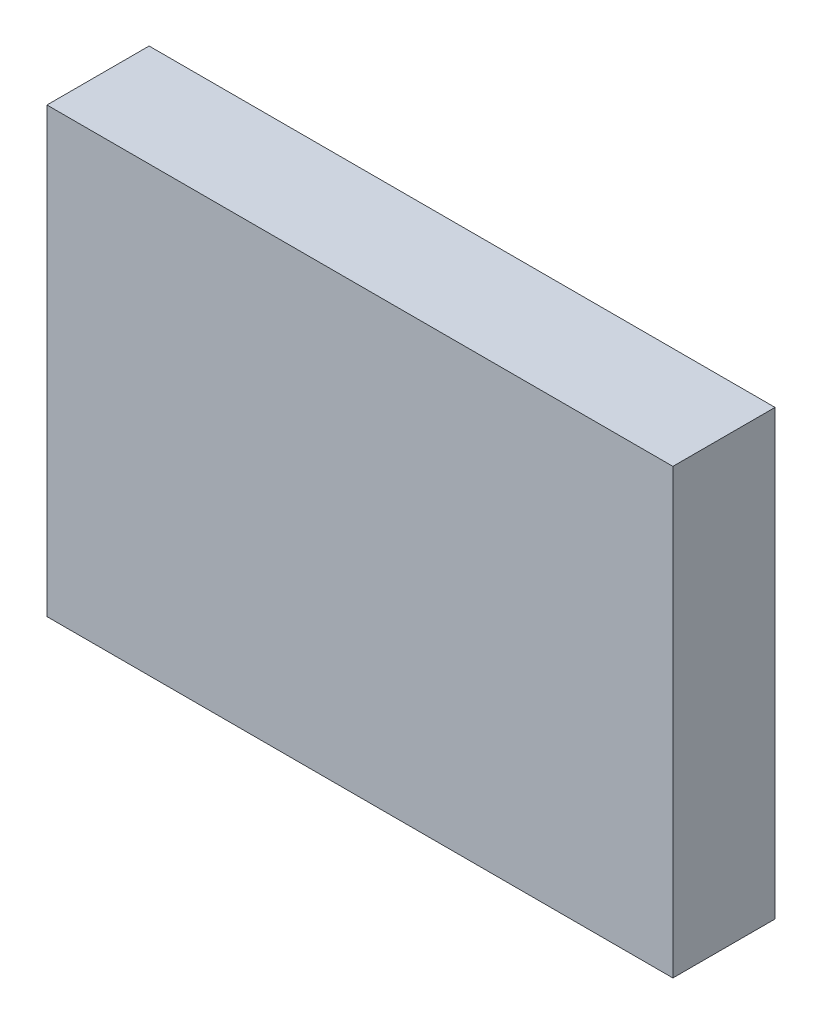
ISO-10303-21;
HEADER;
FILE_DESCRIPTION(('STEP AP214'),'2;1');
FILE_NAME('part.step','',(''),(''),'','','');
FILE_SCHEMA(('AUTOMOTIVE_DESIGN { 1 0 10303 214 1 1 1 1 }'));
ENDSEC;
DATA;
#1=APPLICATION_CONTEXT('core data for automotive mechanical design processes');
#2=APPLICATION_PROTOCOL_DEFINITION('international standard','automotive_design',2000,#1);
#3=PRODUCT_CONTEXT('',#1,'mechanical');
#4=PRODUCT('Part','Part','',(#3));
#5=PRODUCT_RELATED_PRODUCT_CATEGORY('part','',(#4));
#6=PRODUCT_DEFINITION_FORMATION('','',#4);
#7=PRODUCT_DEFINITION_CONTEXT('part definition',#1,'design');
#8=PRODUCT_DEFINITION('design','',#6,#7);
#9=PRODUCT_DEFINITION_SHAPE('','',#8);
#10=(LENGTH_UNIT() NAMED_UNIT(*) SI_UNIT(.MILLI.,.METRE.));
#11=(NAMED_UNIT(*) PLANE_ANGLE_UNIT() SI_UNIT($,.RADIAN.));
#12=(NAMED_UNIT(*) SI_UNIT($,.STERADIAN.) SOLID_ANGLE_UNIT());
#13=UNCERTAINTY_MEASURE_WITH_UNIT(LENGTH_MEASURE(1.E-05),#10,'distance_accuracy_value','');
#14=(GEOMETRIC_REPRESENTATION_CONTEXT(3) GLOBAL_UNCERTAINTY_ASSIGNED_CONTEXT((#13)) GLOBAL_UNIT_ASSIGNED_CONTEXT((#10,
#11,#12)) REPRESENTATION_CONTEXT('',''));
#15=CARTESIAN_POINT('',(0.,0.,0.));
#16=DIRECTION('',(0.,0.,1.));
#17=DIRECTION('',(1.,0.,0.));
#18=AXIS2_PLACEMENT_3D('',#15,#16,#17);
#19=CARTESIAN_POINT('',(-94.2841644233622,55.7449815409714,30.));
#20=DIRECTION('',(1.,0.,0.));
#21=DIRECTION('',(0.,0.,-1.));
#22=AXIS2_PLACEMENT_3D('',#19,#20,#21);
#23=PLANE('',#22);
#24=DIRECTION('',(0.,-1.,0.));
#25=VECTOR('',#24,1.);
#26=CARTESIAN_POINT('',(-94.2841644233622,55.7449815409714,0.));
#27=LINE('',#26,#25);
#28=CARTESIAN_POINT('',(-94.2841644233622,55.7449815409714,0.));
#29=VERTEX_POINT('',#28);
#30=CARTESIAN_POINT('',(-94.2841644233622,-74.3889583692518,0.));
#31=VERTEX_POINT('',#30);
#32=EDGE_CURVE('E123',#29,#31,#27,.T.);
#33=ORIENTED_EDGE('',*,*,#32,.T.);
#34=DIRECTION('',(0.,0.,-1.));
#35=VECTOR('',#34,1.);
#36=CARTESIAN_POINT('',(-94.2841644233622,-74.3889583692518,30.));
#37=LINE('',#36,#35);
#38=CARTESIAN_POINT('',(-94.2841644233622,-74.3889583692518,30.));
#39=VERTEX_POINT('',#38);
#40=EDGE_CURVE('E114',#39,#31,#37,.T.);
#41=ORIENTED_EDGE('',*,*,#40,.F.);
#42=DIRECTION('',(0.,-1.,0.));
#43=VECTOR('',#42,1.);
#44=CARTESIAN_POINT('',(-94.2841644233622,55.7449815409714,30.));
#45=LINE('',#44,#43);
#46=CARTESIAN_POINT('',(-94.2841644233622,55.7449815409714,30.));
#47=VERTEX_POINT('',#46);
#48=EDGE_CURVE('E108',#47,#39,#45,.T.);
#49=ORIENTED_EDGE('',*,*,#48,.F.);
#50=DIRECTION('',(0.,0.,-1.));
#51=VECTOR('',#50,1.);
#52=CARTESIAN_POINT('',(-94.2841644233622,55.7449815409714,30.));
#53=LINE('',#52,#51);
#54=EDGE_CURVE('E119',#47,#29,#53,.T.);
#55=ORIENTED_EDGE('',*,*,#54,.T.);
#56=EDGE_LOOP('',(#33,#41,#49,#55));
#57=FACE_BOUND('',#56,.T.);
#58=ADVANCED_FACE('F17',(#57),#23,.F.);
#59=CARTESIAN_POINT('',(-94.2841644233622,-74.3889583692518,30.));
#60=DIRECTION('',(0.,1.,0.));
#61=DIRECTION('',(0.,0.,1.));
#62=AXIS2_PLACEMENT_3D('',#59,#60,#61);
#63=PLANE('',#62);
#64=DIRECTION('',(1.,0.,0.));
#65=VECTOR('',#64,1.);
#66=CARTESIAN_POINT('',(-94.2841644233622,-74.3889583692518,0.));
#67=LINE('',#66,#65);
#68=CARTESIAN_POINT('',(89.5506165131049,-74.3889583692518,0.));
#69=VERTEX_POINT('',#68);
#70=EDGE_CURVE('E113',#31,#69,#67,.T.);
#71=ORIENTED_EDGE('',*,*,#70,.T.);
#72=DIRECTION('',(0.,0.,-1.));
#73=VECTOR('',#72,1.);
#74=CARTESIAN_POINT('',(89.5506165131049,-74.3889583692518,30.));
#75=LINE('',#74,#73);
#76=CARTESIAN_POINT('',(89.5506165131049,-74.3889583692518,30.));
#77=VERTEX_POINT('',#76);
#78=EDGE_CURVE('E111',#77,#69,#75,.T.);
#79=ORIENTED_EDGE('',*,*,#78,.F.);
#80=DIRECTION('',(1.,0.,0.));
#81=VECTOR('',#80,1.);
#82=CARTESIAN_POINT('',(-94.2841644233622,-74.3889583692518,30.));
#83=LINE('',#82,#81);
#84=EDGE_CURVE('E103',#39,#77,#83,.T.);
#85=ORIENTED_EDGE('',*,*,#84,.F.);
#86=ORIENTED_EDGE('',*,*,#40,.T.);
#87=EDGE_LOOP('',(#71,#79,#85,#86));
#88=FACE_BOUND('',#87,.T.);
#89=ADVANCED_FACE('F112',(#88),#63,.F.);
#90=CARTESIAN_POINT('',(89.5506165131049,55.7449815409714,30.));
#91=DIRECTION('',(-1.,0.,0.));
#92=DIRECTION('',(0.,0.,1.));
#93=AXIS2_PLACEMENT_3D('',#90,#91,#92);
#94=PLANE('',#93);
#95=DIRECTION('',(0.,1.,0.));
#96=VECTOR('',#95,1.);
#97=CARTESIAN_POINT('',(89.5506165131049,55.7449815409714,0.));
#98=LINE('',#97,#96);
#99=CARTESIAN_POINT('',(89.5506165131049,55.7449815409714,0.));
#100=VERTEX_POINT('',#99);
#101=EDGE_CURVE('E89',#69,#100,#98,.T.);
#102=ORIENTED_EDGE('',*,*,#101,.T.);
#103=DIRECTION('',(0.,0.,-1.));
#104=VECTOR('',#103,1.);
#105=CARTESIAN_POINT('',(89.5506165131049,55.7449815409714,30.));
#106=LINE('',#105,#104);
#107=CARTESIAN_POINT('',(89.5506165131049,55.7449815409714,30.));
#108=VERTEX_POINT('',#107);
#109=EDGE_CURVE('E115',#108,#100,#106,.T.);
#110=ORIENTED_EDGE('',*,*,#109,.F.);
#111=DIRECTION('',(0.,1.,0.));
#112=VECTOR('',#111,1.);
#113=CARTESIAN_POINT('',(89.5506165131049,55.7449815409714,30.));
#114=LINE('',#113,#112);
#115=EDGE_CURVE('E106',#77,#108,#114,.T.);
#116=ORIENTED_EDGE('',*,*,#115,.F.);
#117=ORIENTED_EDGE('',*,*,#78,.T.);
#118=EDGE_LOOP('',(#102,#110,#116,#117));
#119=FACE_BOUND('',#118,.T.);
#120=ADVANCED_FACE('F117',(#119),#94,.F.);
#121=CARTESIAN_POINT('',(-94.2841644233622,55.7449815409714,30.));
#122=DIRECTION('',(0.,-1.,0.));
#123=DIRECTION('',(0.,0.,-1.));
#124=AXIS2_PLACEMENT_3D('',#121,#122,#123);
#125=PLANE('',#124);
#126=DIRECTION('',(-1.,0.,0.));
#127=VECTOR('',#126,1.);
#128=CARTESIAN_POINT('',(-94.2841644233622,55.7449815409714,0.));
#129=LINE('',#128,#127);
#130=EDGE_CURVE('E95',#100,#29,#129,.T.);
#131=ORIENTED_EDGE('',*,*,#130,.T.);
#132=ORIENTED_EDGE('',*,*,#54,.F.);
#133=DIRECTION('',(-1.,0.,0.));
#134=VECTOR('',#133,1.);
#135=CARTESIAN_POINT('',(-94.2841644233622,55.7449815409714,30.));
#136=LINE('',#135,#134);
#137=EDGE_CURVE('E72',#108,#47,#136,.T.);
#138=ORIENTED_EDGE('',*,*,#137,.F.);
#139=ORIENTED_EDGE('',*,*,#109,.T.);
#140=EDGE_LOOP('',(#131,#132,#138,#139));
#141=FACE_BOUND('',#140,.T.);
#142=ADVANCED_FACE('F188',(#141),#125,.F.);
#143=CARTESIAN_POINT('',(0.,0.,30.));
#144=DIRECTION('',(0.,0.,1.));
#145=DIRECTION('',(1.,0.,0.));
#146=AXIS2_PLACEMENT_3D('',#143,#144,#145);
#147=PLANE('',#146);
#148=ORIENTED_EDGE('',*,*,#48,.T.);
#149=ORIENTED_EDGE('',*,*,#84,.T.);
#150=ORIENTED_EDGE('',*,*,#115,.T.);
#151=ORIENTED_EDGE('',*,*,#137,.T.);
#152=EDGE_LOOP('',(#148,#149,#150,#151));
#153=FACE_BOUND('',#152,.T.);
#154=ADVANCED_FACE('F104',(#153),#147,.T.);
#155=CARTESIAN_POINT('',(0.,0.,0.));
#156=DIRECTION('',(0.,0.,1.));
#157=DIRECTION('',(1.,0.,0.));
#158=AXIS2_PLACEMENT_3D('',#155,#156,#157);
#159=PLANE('',#158);
#160=ORIENTED_EDGE('',*,*,#32,.F.);
#161=ORIENTED_EDGE('',*,*,#130,.F.);
#162=ORIENTED_EDGE('',*,*,#101,.F.);
#163=ORIENTED_EDGE('',*,*,#70,.F.);
#164=EDGE_LOOP('',(#160,#161,#162,#163));
#165=FACE_BOUND('',#164,.T.);
#166=ADVANCED_FACE('F191',(#165),#159,.F.);
#167=CLOSED_SHELL('',(#58,#89,#120,#142,#154,#166));
#168=CARTESIAN_POINT('',(-93.2841644233622,55.7449815409714,30.));
#169=DIRECTION('',(1.,0.,0.));
#170=DIRECTION('',(0.,0.,-1.));
#171=AXIS2_PLACEMENT_3D('',#168,#169,#170);
#172=PLANE('',#171);
#173=DIRECTION('',(0.,-1.,0.));
#174=VECTOR('',#173,1.);
#175=CARTESIAN_POINT('',(-93.2841644233622,55.7449815409714,1.));
#176=LINE('',#175,#174);
#177=CARTESIAN_POINT('',(-93.2841644233622,54.7449815409714,1.));
#178=VERTEX_POINT('',#177);
#179=CARTESIAN_POINT('',(-93.2841644233622,-73.3889583692518,1.));
#180=VERTEX_POINT('',#179);
#181=EDGE_CURVE('E21',#178,#180,#176,.T.);
#182=ORIENTED_EDGE('',*,*,#181,.F.);
#183=DIRECTION('',(0.,0.,-1.));
#184=VECTOR('',#183,1.);
#185=CARTESIAN_POINT('',(-93.2841644233622,54.7449815409714,30.));
#186=LINE('',#185,#184);
#187=CARTESIAN_POINT('',(-93.2841644233622,54.7449815409714,29.));
#188=VERTEX_POINT('',#187);
#189=EDGE_CURVE('E147',#188,#178,#186,.T.);
#190=ORIENTED_EDGE('',*,*,#189,.F.);
#191=DIRECTION('',(0.,-1.,0.));
#192=VECTOR('',#191,1.);
#193=CARTESIAN_POINT('',(-93.2841644233622,55.7449815409714,29.));
#194=LINE('',#193,#192);
#195=CARTESIAN_POINT('',(-93.2841644233622,-73.3889583692518,29.));
#196=VERTEX_POINT('',#195);
#197=EDGE_CURVE('E134',#188,#196,#194,.T.);
#198=ORIENTED_EDGE('',*,*,#197,.T.);
#199=DIRECTION('',(0.,0.,-1.));
#200=VECTOR('',#199,1.);
#201=CARTESIAN_POINT('',(-93.2841644233622,-73.3889583692518,30.));
#202=LINE('',#201,#200);
#203=EDGE_CURVE('E145',#196,#180,#202,.T.);
#204=ORIENTED_EDGE('',*,*,#203,.T.);
#205=EDGE_LOOP('',(#182,#190,#198,#204));
#206=FACE_BOUND('',#205,.T.);
#207=ADVANCED_FACE('F154',(#206),#172,.T.);
#208=CARTESIAN_POINT('',(-94.2841644233622,-73.3889583692518,30.));
#209=DIRECTION('',(0.,1.,0.));
#210=DIRECTION('',(0.,0.,1.));
#211=AXIS2_PLACEMENT_3D('',#208,#209,#210);
#212=PLANE('',#211);
#213=DIRECTION('',(1.,0.,0.));
#214=VECTOR('',#213,1.);
#215=CARTESIAN_POINT('',(-94.2841644233622,-73.3889583692518,1.));
#216=LINE('',#215,#214);
#217=CARTESIAN_POINT('',(88.5506165131049,-73.3889583692518,1.));
#218=VERTEX_POINT('',#217);
#219=EDGE_CURVE('E37',#180,#218,#216,.T.);
#220=ORIENTED_EDGE('',*,*,#219,.F.);
#221=ORIENTED_EDGE('',*,*,#203,.F.);
#222=DIRECTION('',(1.,0.,0.));
#223=VECTOR('',#222,1.);
#224=CARTESIAN_POINT('',(-94.2841644233622,-73.3889583692518,29.));
#225=LINE('',#224,#223);
#226=CARTESIAN_POINT('',(88.5506165131049,-73.3889583692518,29.));
#227=VERTEX_POINT('',#226);
#228=EDGE_CURVE('E60',#196,#227,#225,.T.);
#229=ORIENTED_EDGE('',*,*,#228,.T.);
#230=DIRECTION('',(0.,0.,-1.));
#231=VECTOR('',#230,1.);
#232=CARTESIAN_POINT('',(88.5506165131049,-73.3889583692518,30.));
#233=LINE('',#232,#231);
#234=EDGE_CURVE('E141',#227,#218,#233,.T.);
#235=ORIENTED_EDGE('',*,*,#234,.T.);
#236=EDGE_LOOP('',(#220,#221,#229,#235));
#237=FACE_BOUND('',#236,.T.);
#238=ADVANCED_FACE('F155',(#237),#212,.T.);
#239=CARTESIAN_POINT('',(88.5506165131049,55.7449815409714,30.));
#240=DIRECTION('',(-1.,0.,0.));
#241=DIRECTION('',(0.,0.,1.));
#242=AXIS2_PLACEMENT_3D('',#239,#240,#241);
#243=PLANE('',#242);
#244=DIRECTION('',(0.,1.,0.));
#245=VECTOR('',#244,1.);
#246=CARTESIAN_POINT('',(88.5506165131049,55.7449815409714,1.));
#247=LINE('',#246,#245);
#248=CARTESIAN_POINT('',(88.5506165131049,54.7449815409714,1.));
#249=VERTEX_POINT('',#248);
#250=EDGE_CURVE('E143',#218,#249,#247,.T.);
#251=ORIENTED_EDGE('',*,*,#250,.F.);
#252=ORIENTED_EDGE('',*,*,#234,.F.);
#253=DIRECTION('',(0.,1.,0.));
#254=VECTOR('',#253,1.);
#255=CARTESIAN_POINT('',(88.5506165131049,55.7449815409714,29.));
#256=LINE('',#255,#254);
#257=CARTESIAN_POINT('',(88.5506165131049,54.7449815409714,29.));
#258=VERTEX_POINT('',#257);
#259=EDGE_CURVE('E28',#227,#258,#256,.T.);
#260=ORIENTED_EDGE('',*,*,#259,.T.);
#261=DIRECTION('',(0.,0.,-1.));
#262=VECTOR('',#261,1.);
#263=CARTESIAN_POINT('',(88.5506165131049,54.7449815409714,30.));
#264=LINE('',#263,#262);
#265=EDGE_CURVE('E136',#258,#249,#264,.T.);
#266=ORIENTED_EDGE('',*,*,#265,.T.);
#267=EDGE_LOOP('',(#251,#252,#260,#266));
#268=FACE_BOUND('',#267,.T.);
#269=ADVANCED_FACE('F159',(#268),#243,.T.);
#270=CARTESIAN_POINT('',(-94.2841644233622,54.7449815409714,30.));
#271=DIRECTION('',(0.,-1.,0.));
#272=DIRECTION('',(0.,0.,-1.));
#273=AXIS2_PLACEMENT_3D('',#270,#271,#272);
#274=PLANE('',#273);
#275=DIRECTION('',(-1.,0.,0.));
#276=VECTOR('',#275,1.);
#277=CARTESIAN_POINT('',(-94.2841644233622,54.7449815409714,1.));
#278=LINE('',#277,#276);
#279=EDGE_CURVE('E139',#249,#178,#278,.T.);
#280=ORIENTED_EDGE('',*,*,#279,.F.);
#281=ORIENTED_EDGE('',*,*,#265,.F.);
#282=DIRECTION('',(-1.,0.,0.));
#283=VECTOR('',#282,1.);
#284=CARTESIAN_POINT('',(-94.2841644233622,54.7449815409714,29.));
#285=LINE('',#284,#283);
#286=EDGE_CURVE('E10',#258,#188,#285,.T.);
#287=ORIENTED_EDGE('',*,*,#286,.T.);
#288=ORIENTED_EDGE('',*,*,#189,.T.);
#289=EDGE_LOOP('',(#280,#281,#287,#288));
#290=FACE_BOUND('',#289,.T.);
#291=ADVANCED_FACE('F163',(#290),#274,.T.);
#292=CARTESIAN_POINT('',(0.,0.,29.));
#293=DIRECTION('',(0.,0.,1.));
#294=DIRECTION('',(1.,0.,0.));
#295=AXIS2_PLACEMENT_3D('',#292,#293,#294);
#296=PLANE('',#295);
#297=ORIENTED_EDGE('',*,*,#197,.F.);
#298=ORIENTED_EDGE('',*,*,#286,.F.);
#299=ORIENTED_EDGE('',*,*,#259,.F.);
#300=ORIENTED_EDGE('',*,*,#228,.F.);
#301=EDGE_LOOP('',(#297,#298,#299,#300));
#302=FACE_BOUND('',#301,.T.);
#303=ADVANCED_FACE('F162',(#302),#296,.F.);
#304=CARTESIAN_POINT('',(0.,0.,1.));
#305=DIRECTION('',(0.,0.,1.));
#306=DIRECTION('',(1.,0.,0.));
#307=AXIS2_PLACEMENT_3D('',#304,#305,#306);
#308=PLANE('',#307);
#309=ORIENTED_EDGE('',*,*,#181,.T.);
#310=ORIENTED_EDGE('',*,*,#219,.T.);
#311=ORIENTED_EDGE('',*,*,#250,.T.);
#312=ORIENTED_EDGE('',*,*,#279,.T.);
#313=EDGE_LOOP('',(#309,#310,#311,#312));
#314=FACE_BOUND('',#313,.T.);
#315=ADVANCED_FACE('F19',(#314),#308,.T.);
#316=CLOSED_SHELL('',(#207,#238,#269,#291,#303,#315));
#317=ORIENTED_CLOSED_SHELL('',*,#316,.T.);
#318=BREP_WITH_VOIDS('B1',#167,(#317));
#319=ADVANCED_BREP_SHAPE_REPRESENTATION('',(#18,#318),#14);
#320=SHAPE_DEFINITION_REPRESENTATION(#9,#319);
ENDSEC;
END-ISO-10303-21;
